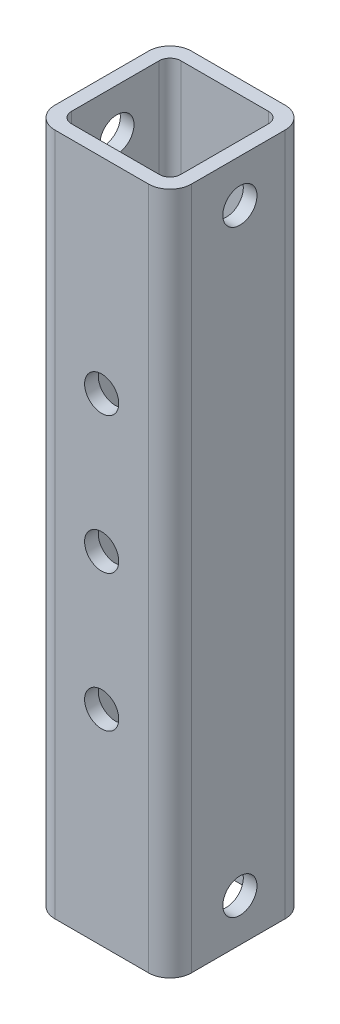
ISO-10303-21;
HEADER;
FILE_DESCRIPTION(('STEP AP214'),'2;1');
FILE_NAME('part.step','',(''),(''),'','','');
FILE_SCHEMA(('AUTOMOTIVE_DESIGN { 1 0 10303 214 1 1 1 1 }'));
ENDSEC;
DATA;
#1=APPLICATION_CONTEXT('core data for automotive mechanical design processes');
#2=APPLICATION_PROTOCOL_DEFINITION('international standard','automotive_design',2000,#1);
#3=PRODUCT_CONTEXT('',#1,'mechanical');
#4=PRODUCT('Part','Part','',(#3));
#5=PRODUCT_RELATED_PRODUCT_CATEGORY('part','',(#4));
#6=PRODUCT_DEFINITION_FORMATION('','',#4);
#7=PRODUCT_DEFINITION_CONTEXT('part definition',#1,'design');
#8=PRODUCT_DEFINITION('design','',#6,#7);
#9=PRODUCT_DEFINITION_SHAPE('','',#8);
#10=(LENGTH_UNIT() NAMED_UNIT(*) SI_UNIT(.MILLI.,.METRE.));
#11=(NAMED_UNIT(*) PLANE_ANGLE_UNIT() SI_UNIT($,.RADIAN.));
#12=(NAMED_UNIT(*) SI_UNIT($,.STERADIAN.) SOLID_ANGLE_UNIT());
#13=UNCERTAINTY_MEASURE_WITH_UNIT(LENGTH_MEASURE(1.E-05),#10,'distance_accuracy_value','');
#14=(GEOMETRIC_REPRESENTATION_CONTEXT(3) GLOBAL_UNCERTAINTY_ASSIGNED_CONTEXT((#13)) GLOBAL_UNIT_ASSIGNED_CONTEXT((#10,
#11,#12)) REPRESENTATION_CONTEXT('',''));
#15=CARTESIAN_POINT('',(0.,0.,0.));
#16=DIRECTION('',(0.,0.,1.));
#17=DIRECTION('',(1.,0.,0.));
#18=AXIS2_PLACEMENT_3D('',#15,#16,#17);
#19=CARTESIAN_POINT('',(4.,127.,-21.4));
#20=DIRECTION('',(0.,-1.,0.));
#21=DIRECTION('',(0.,0.,-1.));
#22=AXIS2_PLACEMENT_3D('',#19,#20,#21);
#23=PLANE('',#22);
#24=CARTESIAN_POINT('',(4.,127.,-21.4));
#25=DIRECTION('',(0.,1.,0.));
#26=DIRECTION('',(0.,0.,-1.));
#27=AXIS2_PLACEMENT_3D('',#24,#25,#26);
#28=CIRCLE('',#27,4.);
#29=CARTESIAN_POINT('',(4.00000000000003,127.,-25.4));
#30=VERTEX_POINT('',#29);
#31=CARTESIAN_POINT('',(0.,127.,-21.4));
#32=VERTEX_POINT('',#31);
#33=EDGE_CURVE('E227',#30,#32,#28,.T.);
#34=ORIENTED_EDGE('',*,*,#33,.T.);
#35=DIRECTION('',(0.,0.,1.));
#36=VECTOR('',#35,1.);
#37=CARTESIAN_POINT('',(0.,127.,-4.00000000000003));
#38=LINE('',#37,#36);
#39=CARTESIAN_POINT('',(0.,127.,-4.00000000000003));
#40=VERTEX_POINT('',#39);
#41=EDGE_CURVE('E230',#32,#40,#38,.T.);
#42=ORIENTED_EDGE('',*,*,#41,.T.);
#43=CARTESIAN_POINT('',(4.,127.,-4.));
#44=DIRECTION('',(0.,1.,0.));
#45=DIRECTION('',(0.,0.,-1.));
#46=AXIS2_PLACEMENT_3D('',#43,#44,#45);
#47=CIRCLE('',#46,4.);
#48=CARTESIAN_POINT('',(4.00000000000003,127.,0.));
#49=VERTEX_POINT('',#48);
#50=EDGE_CURVE('E233',#40,#49,#47,.T.);
#51=ORIENTED_EDGE('',*,*,#50,.T.);
#52=DIRECTION('',(1.,0.,0.));
#53=VECTOR('',#52,1.);
#54=CARTESIAN_POINT('',(4.00000000000003,127.,0.));
#55=LINE('',#54,#53);
#56=CARTESIAN_POINT('',(21.4,127.,0.));
#57=VERTEX_POINT('',#56);
#58=EDGE_CURVE('E235',#49,#57,#55,.T.);
#59=ORIENTED_EDGE('',*,*,#58,.T.);
#60=CARTESIAN_POINT('',(21.4,127.,-4.));
#61=DIRECTION('',(0.,1.,0.));
#62=DIRECTION('',(0.,0.,1.));
#63=AXIS2_PLACEMENT_3D('',#60,#61,#62);
#64=CIRCLE('',#63,4.);
#65=CARTESIAN_POINT('',(25.4,127.,-4.00000000000003));
#66=VERTEX_POINT('',#65);
#67=EDGE_CURVE('E237',#57,#66,#64,.T.);
#68=ORIENTED_EDGE('',*,*,#67,.T.);
#69=DIRECTION('',(0.,0.,-1.));
#70=VECTOR('',#69,1.);
#71=CARTESIAN_POINT('',(25.4,127.,-4.00000000000003));
#72=LINE('',#71,#70);
#73=CARTESIAN_POINT('',(25.4,127.,-21.4));
#74=VERTEX_POINT('',#73);
#75=EDGE_CURVE('E239',#66,#74,#72,.T.);
#76=ORIENTED_EDGE('',*,*,#75,.T.);
#77=CARTESIAN_POINT('',(21.4,127.,-21.4));
#78=DIRECTION('',(0.,1.,0.));
#79=DIRECTION('',(0.,0.,-1.));
#80=AXIS2_PLACEMENT_3D('',#77,#78,#79);
#81=CIRCLE('',#80,4.);
#82=CARTESIAN_POINT('',(21.4,127.,-25.4));
#83=VERTEX_POINT('',#82);
#84=EDGE_CURVE('E241',#74,#83,#81,.T.);
#85=ORIENTED_EDGE('',*,*,#84,.T.);
#86=DIRECTION('',(-1.,0.,0.));
#87=VECTOR('',#86,1.);
#88=CARTESIAN_POINT('',(4.00000000000003,127.,-25.4));
#89=LINE('',#88,#87);
#90=EDGE_CURVE('E243',#83,#30,#89,.T.);
#91=ORIENTED_EDGE('',*,*,#90,.T.);
#92=EDGE_LOOP('',(#34,#42,#51,#59,#68,#76,#85,#91));
#93=FACE_BOUND('',#92,.T.);
#94=CARTESIAN_POINT('',(4.54,127.,-20.86));
#95=DIRECTION('',(0.,1.,0.));
#96=DIRECTION('',(0.,0.,-1.));
#97=AXIS2_PLACEMENT_3D('',#94,#95,#96);
#98=CIRCLE('',#97,2.);
#99=CARTESIAN_POINT('',(4.54000000000002,127.,-22.86));
#100=VERTEX_POINT('',#99);
#101=CARTESIAN_POINT('',(2.54,127.,-20.86));
#102=VERTEX_POINT('',#101);
#103=EDGE_CURVE('E160',#100,#102,#98,.T.);
#104=ORIENTED_EDGE('',*,*,#103,.F.);
#105=DIRECTION('',(-1.,0.,0.));
#106=VECTOR('',#105,1.);
#107=CARTESIAN_POINT('',(20.86,127.,-22.86));
#108=LINE('',#107,#106);
#109=CARTESIAN_POINT('',(20.86,127.,-22.86));
#110=VERTEX_POINT('',#109);
#111=EDGE_CURVE('E194',#110,#100,#108,.T.);
#112=ORIENTED_EDGE('',*,*,#111,.F.);
#113=CARTESIAN_POINT('',(20.86,127.,-20.86));
#114=DIRECTION('',(0.,1.,0.));
#115=DIRECTION('',(0.,0.,1.));
#116=AXIS2_PLACEMENT_3D('',#113,#114,#115);
#117=CIRCLE('',#116,2.);
#118=CARTESIAN_POINT('',(22.86,127.,-20.86));
#119=VERTEX_POINT('',#118);
#120=EDGE_CURVE('E192',#119,#110,#117,.T.);
#121=ORIENTED_EDGE('',*,*,#120,.F.);
#122=DIRECTION('',(0.,0.,-1.));
#123=VECTOR('',#122,1.);
#124=CARTESIAN_POINT('',(22.86,127.,-4.54000000000001));
#125=LINE('',#124,#123);
#126=CARTESIAN_POINT('',(22.86,127.,-4.54000000000001));
#127=VERTEX_POINT('',#126);
#128=EDGE_CURVE('E190',#127,#119,#125,.T.);
#129=ORIENTED_EDGE('',*,*,#128,.F.);
#130=CARTESIAN_POINT('',(20.86,127.,-4.54));
#131=DIRECTION('',(0.,1.,0.));
#132=DIRECTION('',(0.,0.,-1.));
#133=AXIS2_PLACEMENT_3D('',#130,#131,#132);
#134=CIRCLE('',#133,2.);
#135=CARTESIAN_POINT('',(20.86,127.,-2.54));
#136=VERTEX_POINT('',#135);
#137=EDGE_CURVE('E188',#136,#127,#134,.T.);
#138=ORIENTED_EDGE('',*,*,#137,.F.);
#139=DIRECTION('',(1.,0.,0.));
#140=VECTOR('',#139,1.);
#141=CARTESIAN_POINT('',(20.86,127.,-2.54));
#142=LINE('',#141,#140);
#143=CARTESIAN_POINT('',(4.54000000000002,127.,-2.54));
#144=VERTEX_POINT('',#143);
#145=EDGE_CURVE('E183',#144,#136,#142,.T.);
#146=ORIENTED_EDGE('',*,*,#145,.F.);
#147=CARTESIAN_POINT('',(4.54,127.,-4.54));
#148=DIRECTION('',(0.,1.,0.));
#149=DIRECTION('',(0.,0.,-1.));
#150=AXIS2_PLACEMENT_3D('',#147,#148,#149);
#151=CIRCLE('',#150,2.);
#152=CARTESIAN_POINT('',(2.54,127.,-4.54000000000001));
#153=VERTEX_POINT('',#152);
#154=EDGE_CURVE('E181',#153,#144,#151,.T.);
#155=ORIENTED_EDGE('',*,*,#154,.F.);
#156=DIRECTION('',(0.,0.,1.));
#157=VECTOR('',#156,1.);
#158=CARTESIAN_POINT('',(2.54,127.,-4.54000000000001));
#159=LINE('',#158,#157);
#160=EDGE_CURVE('E168',#102,#153,#159,.T.);
#161=ORIENTED_EDGE('',*,*,#160,.F.);
#162=EDGE_LOOP('',(#104,#112,#121,#129,#138,#146,#155,#161));
#163=FACE_BOUND('',#162,.T.);
#164=ADVANCED_FACE('F45',(#93,#163),#23,.F.);
#165=CARTESIAN_POINT('',(4.,0.,-21.4));
#166=DIRECTION('',(0.,-1.,0.));
#167=DIRECTION('',(0.,0.,-1.));
#168=AXIS2_PLACEMENT_3D('',#165,#166,#167);
#169=PLANE('',#168);
#170=CARTESIAN_POINT('',(4.,0.,-21.4));
#171=DIRECTION('',(0.,1.,0.));
#172=DIRECTION('',(0.,0.,-1.));
#173=AXIS2_PLACEMENT_3D('',#170,#171,#172);
#174=CIRCLE('',#173,4.);
#175=CARTESIAN_POINT('',(4.00000000000003,0.,-25.4));
#176=VERTEX_POINT('',#175);
#177=CARTESIAN_POINT('',(0.,0.,-21.4));
#178=VERTEX_POINT('',#177);
#179=EDGE_CURVE('E176',#176,#178,#174,.T.);
#180=ORIENTED_EDGE('',*,*,#179,.F.);
#181=DIRECTION('',(-1.,0.,0.));
#182=VECTOR('',#181,1.);
#183=CARTESIAN_POINT('',(4.00000000000003,0.,-25.4));
#184=LINE('',#183,#182);
#185=CARTESIAN_POINT('',(21.4,0.,-25.4));
#186=VERTEX_POINT('',#185);
#187=EDGE_CURVE('E231',#186,#176,#184,.T.);
#188=ORIENTED_EDGE('',*,*,#187,.F.);
#189=CARTESIAN_POINT('',(21.4,0.,-21.4));
#190=DIRECTION('',(0.,1.,0.));
#191=DIRECTION('',(0.,0.,-1.));
#192=AXIS2_PLACEMENT_3D('',#189,#190,#191);
#193=CIRCLE('',#192,4.);
#194=CARTESIAN_POINT('',(25.4,0.,-21.4));
#195=VERTEX_POINT('',#194);
#196=EDGE_CURVE('E258',#195,#186,#193,.T.);
#197=ORIENTED_EDGE('',*,*,#196,.F.);
#198=DIRECTION('',(0.,0.,-1.));
#199=VECTOR('',#198,1.);
#200=CARTESIAN_POINT('',(25.4,0.,-4.00000000000003));
#201=LINE('',#200,#199);
#202=CARTESIAN_POINT('',(25.4,0.,-4.00000000000003));
#203=VERTEX_POINT('',#202);
#204=EDGE_CURVE('E256',#203,#195,#201,.T.);
#205=ORIENTED_EDGE('',*,*,#204,.F.);
#206=CARTESIAN_POINT('',(21.4,0.,-4.));
#207=DIRECTION('',(0.,1.,0.));
#208=DIRECTION('',(0.,0.,1.));
#209=AXIS2_PLACEMENT_3D('',#206,#207,#208);
#210=CIRCLE('',#209,4.);
#211=CARTESIAN_POINT('',(21.4,0.,0.));
#212=VERTEX_POINT('',#211);
#213=EDGE_CURVE('E254',#212,#203,#210,.T.);
#214=ORIENTED_EDGE('',*,*,#213,.F.);
#215=DIRECTION('',(1.,0.,0.));
#216=VECTOR('',#215,1.);
#217=CARTESIAN_POINT('',(4.00000000000003,0.,0.));
#218=LINE('',#217,#216);
#219=CARTESIAN_POINT('',(4.00000000000003,0.,0.));
#220=VERTEX_POINT('',#219);
#221=EDGE_CURVE('E252',#220,#212,#218,.T.);
#222=ORIENTED_EDGE('',*,*,#221,.F.);
#223=CARTESIAN_POINT('',(4.,0.,-4.));
#224=DIRECTION('',(0.,1.,0.));
#225=DIRECTION('',(0.,0.,-1.));
#226=AXIS2_PLACEMENT_3D('',#223,#224,#225);
#227=CIRCLE('',#226,4.);
#228=CARTESIAN_POINT('',(0.,0.,-4.00000000000003));
#229=VERTEX_POINT('',#228);
#230=EDGE_CURVE('E250',#229,#220,#227,.T.);
#231=ORIENTED_EDGE('',*,*,#230,.F.);
#232=DIRECTION('',(0.,0.,1.));
#233=VECTOR('',#232,1.);
#234=CARTESIAN_POINT('',(0.,0.,-4.00000000000003));
#235=LINE('',#234,#233);
#236=EDGE_CURVE('E248',#178,#229,#235,.T.);
#237=ORIENTED_EDGE('',*,*,#236,.F.);
#238=EDGE_LOOP('',(#180,#188,#197,#205,#214,#222,#231,#237));
#239=FACE_BOUND('',#238,.T.);
#240=DIRECTION('',(-1.,0.,0.));
#241=VECTOR('',#240,1.);
#242=CARTESIAN_POINT('',(20.86,0.,-22.86));
#243=LINE('',#242,#241);
#244=CARTESIAN_POINT('',(20.86,0.,-22.86));
#245=VERTEX_POINT('',#244);
#246=CARTESIAN_POINT('',(4.54000000000002,0.,-22.86));
#247=VERTEX_POINT('',#246);
#248=EDGE_CURVE('E169',#245,#247,#243,.T.);
#249=ORIENTED_EDGE('',*,*,#248,.T.);
#250=CARTESIAN_POINT('',(4.54,0.,-20.86));
#251=DIRECTION('',(0.,1.,0.));
#252=DIRECTION('',(0.,0.,-1.));
#253=AXIS2_PLACEMENT_3D('',#250,#251,#252);
#254=CIRCLE('',#253,2.);
#255=CARTESIAN_POINT('',(2.54,0.,-20.86));
#256=VERTEX_POINT('',#255);
#257=EDGE_CURVE('E70',#247,#256,#254,.T.);
#258=ORIENTED_EDGE('',*,*,#257,.T.);
#259=DIRECTION('',(0.,0.,1.));
#260=VECTOR('',#259,1.);
#261=CARTESIAN_POINT('',(2.54,0.,-4.54000000000001));
#262=LINE('',#261,#260);
#263=CARTESIAN_POINT('',(2.54,0.,-4.54000000000001));
#264=VERTEX_POINT('',#263);
#265=EDGE_CURVE('E175',#256,#264,#262,.T.);
#266=ORIENTED_EDGE('',*,*,#265,.T.);
#267=CARTESIAN_POINT('',(4.54,0.,-4.54));
#268=DIRECTION('',(0.,1.,0.));
#269=DIRECTION('',(0.,0.,-1.));
#270=AXIS2_PLACEMENT_3D('',#267,#268,#269);
#271=CIRCLE('',#270,2.);
#272=CARTESIAN_POINT('',(4.54000000000002,0.,-2.54));
#273=VERTEX_POINT('',#272);
#274=EDGE_CURVE('E199',#264,#273,#271,.T.);
#275=ORIENTED_EDGE('',*,*,#274,.T.);
#276=DIRECTION('',(1.,0.,0.));
#277=VECTOR('',#276,1.);
#278=CARTESIAN_POINT('',(20.86,0.,-2.54));
#279=LINE('',#278,#277);
#280=CARTESIAN_POINT('',(20.86,0.,-2.54));
#281=VERTEX_POINT('',#280);
#282=EDGE_CURVE('E202',#273,#281,#279,.T.);
#283=ORIENTED_EDGE('',*,*,#282,.T.);
#284=CARTESIAN_POINT('',(20.86,0.,-4.54));
#285=DIRECTION('',(0.,1.,0.));
#286=DIRECTION('',(0.,0.,-1.));
#287=AXIS2_PLACEMENT_3D('',#284,#285,#286);
#288=CIRCLE('',#287,2.);
#289=CARTESIAN_POINT('',(22.86,0.,-4.54000000000001));
#290=VERTEX_POINT('',#289);
#291=EDGE_CURVE('E205',#281,#290,#288,.T.);
#292=ORIENTED_EDGE('',*,*,#291,.T.);
#293=DIRECTION('',(0.,0.,-1.));
#294=VECTOR('',#293,1.);
#295=CARTESIAN_POINT('',(22.86,0.,-4.54000000000001));
#296=LINE('',#295,#294);
#297=CARTESIAN_POINT('',(22.86,0.,-20.86));
#298=VERTEX_POINT('',#297);
#299=EDGE_CURVE('E208',#290,#298,#296,.T.);
#300=ORIENTED_EDGE('',*,*,#299,.T.);
#301=CARTESIAN_POINT('',(20.86,0.,-20.86));
#302=DIRECTION('',(0.,1.,0.));
#303=DIRECTION('',(0.,0.,1.));
#304=AXIS2_PLACEMENT_3D('',#301,#302,#303);
#305=CIRCLE('',#304,2.);
#306=EDGE_CURVE('E211',#298,#245,#305,.T.);
#307=ORIENTED_EDGE('',*,*,#306,.T.);
#308=EDGE_LOOP('',(#249,#258,#266,#275,#283,#292,#300,#307));
#309=FACE_BOUND('',#308,.T.);
#310=ADVANCED_FACE('F362',(#239,#309),#169,.T.);
#311=CARTESIAN_POINT('',(4.,127.,-21.4));
#312=DIRECTION('',(0.,-1.,0.));
#313=DIRECTION('',(0.,0.,-1.));
#314=AXIS2_PLACEMENT_3D('',#311,#312,#313);
#315=CYLINDRICAL_SURFACE('',#314,4.);
#316=ORIENTED_EDGE('',*,*,#179,.T.);
#317=DIRECTION('',(0.,-1.,0.));
#318=VECTOR('',#317,1.);
#319=CARTESIAN_POINT('',(0.,127.,-21.4));
#320=LINE('',#319,#318);
#321=EDGE_CURVE('E13',#32,#178,#320,.T.);
#322=ORIENTED_EDGE('',*,*,#321,.F.);
#323=ORIENTED_EDGE('',*,*,#33,.F.);
#324=DIRECTION('',(0.,-1.,0.));
#325=VECTOR('',#324,1.);
#326=CARTESIAN_POINT('',(4.00000000000003,127.,-25.4));
#327=LINE('',#326,#325);
#328=EDGE_CURVE('E245',#30,#176,#327,.T.);
#329=ORIENTED_EDGE('',*,*,#328,.T.);
#330=EDGE_LOOP('',(#316,#322,#323,#329));
#331=FACE_BOUND('',#330,.T.);
#332=ADVANCED_FACE('F47',(#331),#315,.T.);
#333=CARTESIAN_POINT('',(0.,127.,-4.00000000000003));
#334=DIRECTION('',(1.,0.,0.));
#335=DIRECTION('',(0.,0.,-1.));
#336=AXIS2_PLACEMENT_3D('',#333,#334,#335);
#337=PLANE('',#336);
#338=CARTESIAN_POINT('',(0.,119.0625,-12.9920999999989));
#339=DIRECTION('',(1.,0.,0.));
#340=DIRECTION('',(0.,0.,-1.));
#341=AXIS2_PLACEMENT_3D('',#338,#339,#340);
#342=CIRCLE('',#341,3.175);
#343=CARTESIAN_POINT('',(0.,119.0625,-16.1670999999989));
#344=VERTEX_POINT('',#343);
#345=EDGE_CURVE('E325',#344,#344,#342,.T.);
#346=ORIENTED_EDGE('',*,*,#345,.T.);
#347=EDGE_LOOP('',(#346));
#348=FACE_BOUND('',#347,.T.);
#349=CARTESIAN_POINT('',(0.,7.93749999999997,-12.9920999999988));
#350=DIRECTION('',(1.,0.,0.));
#351=DIRECTION('',(0.,0.,-1.));
#352=AXIS2_PLACEMENT_3D('',#349,#350,#351);
#353=CIRCLE('',#352,3.175);
#354=CARTESIAN_POINT('',(0.,7.93749999999997,-16.1670999999988));
#355=VERTEX_POINT('',#354);
#356=EDGE_CURVE('E332',#355,#355,#353,.T.);
#357=ORIENTED_EDGE('',*,*,#356,.T.);
#358=EDGE_LOOP('',(#357));
#359=FACE_BOUND('',#358,.T.);
#360=ORIENTED_EDGE('',*,*,#236,.T.);
#361=DIRECTION('',(0.,-1.,0.));
#362=VECTOR('',#361,1.);
#363=CARTESIAN_POINT('',(0.,127.,-4.00000000000003));
#364=LINE('',#363,#362);
#365=EDGE_CURVE('E54',#40,#229,#364,.T.);
#366=ORIENTED_EDGE('',*,*,#365,.F.);
#367=ORIENTED_EDGE('',*,*,#41,.F.);
#368=ORIENTED_EDGE('',*,*,#321,.T.);
#369=EDGE_LOOP('',(#360,#366,#367,#368));
#370=FACE_BOUND('',#369,.T.);
#371=ADVANCED_FACE('F348',(#348,#359,#370),#337,.F.);
#372=CARTESIAN_POINT('',(4.,127.,-4.));
#373=DIRECTION('',(0.,-1.,0.));
#374=DIRECTION('',(0.,0.,-1.));
#375=AXIS2_PLACEMENT_3D('',#372,#373,#374);
#376=CYLINDRICAL_SURFACE('',#375,4.);
#377=ORIENTED_EDGE('',*,*,#230,.T.);
#378=DIRECTION('',(0.,-1.,0.));
#379=VECTOR('',#378,1.);
#380=CARTESIAN_POINT('',(4.00000000000003,127.,0.));
#381=LINE('',#380,#379);
#382=EDGE_CURVE('E275',#49,#220,#381,.T.);
#383=ORIENTED_EDGE('',*,*,#382,.F.);
#384=ORIENTED_EDGE('',*,*,#50,.F.);
#385=ORIENTED_EDGE('',*,*,#365,.T.);
#386=EDGE_LOOP('',(#377,#383,#384,#385));
#387=FACE_BOUND('',#386,.T.);
#388=ADVANCED_FACE('F351',(#387),#376,.T.);
#389=CARTESIAN_POINT('',(4.00000000000003,127.,0.));
#390=DIRECTION('',(0.,0.,-1.));
#391=DIRECTION('',(-1.,0.,0.));
#392=AXIS2_PLACEMENT_3D('',#389,#390,#391);
#393=PLANE('',#392);
#394=CARTESIAN_POINT('',(12.6995125739966,63.5000000000006,0.));
#395=DIRECTION('',(0.,0.,-1.));
#396=DIRECTION('',(-1.,0.,0.));
#397=AXIS2_PLACEMENT_3D('',#394,#395,#396);
#398=CIRCLE('',#397,3.17500000000001);
#399=CARTESIAN_POINT('',(9.52451257399659,63.5000000000006,0.));
#400=VERTEX_POINT('',#399);
#401=EDGE_CURVE('E296',#400,#400,#398,.T.);
#402=ORIENTED_EDGE('',*,*,#401,.T.);
#403=EDGE_LOOP('',(#402));
#404=FACE_BOUND('',#403,.T.);
#405=CARTESIAN_POINT('',(12.6995125739963,38.1000000000006,0.));
#406=DIRECTION('',(0.,0.,-1.));
#407=DIRECTION('',(-1.,0.,0.));
#408=AXIS2_PLACEMENT_3D('',#405,#406,#407);
#409=CIRCLE('',#408,3.17500000000001);
#410=CARTESIAN_POINT('',(9.52451257399631,38.1000000000006,0.));
#411=VERTEX_POINT('',#410);
#412=EDGE_CURVE('E303',#411,#411,#409,.T.);
#413=ORIENTED_EDGE('',*,*,#412,.T.);
#414=EDGE_LOOP('',(#413));
#415=FACE_BOUND('',#414,.T.);
#416=CARTESIAN_POINT('',(12.6995125739967,88.9000000000006,0.));
#417=DIRECTION('',(0.,0.,-1.));
#418=DIRECTION('',(-1.,0.,0.));
#419=AXIS2_PLACEMENT_3D('',#416,#417,#418);
#420=CIRCLE('',#419,3.17499999999998);
#421=CARTESIAN_POINT('',(9.52451257399667,88.9000000000006,0.));
#422=VERTEX_POINT('',#421);
#423=EDGE_CURVE('E292',#422,#422,#420,.T.);
#424=ORIENTED_EDGE('',*,*,#423,.T.);
#425=EDGE_LOOP('',(#424));
#426=FACE_BOUND('',#425,.T.);
#427=ORIENTED_EDGE('',*,*,#221,.T.);
#428=DIRECTION('',(0.,-1.,0.));
#429=VECTOR('',#428,1.);
#430=CARTESIAN_POINT('',(21.4,127.,0.));
#431=LINE('',#430,#429);
#432=EDGE_CURVE('E272',#57,#212,#431,.T.);
#433=ORIENTED_EDGE('',*,*,#432,.F.);
#434=ORIENTED_EDGE('',*,*,#58,.F.);
#435=ORIENTED_EDGE('',*,*,#382,.T.);
#436=EDGE_LOOP('',(#427,#433,#434,#435));
#437=FACE_BOUND('',#436,.T.);
#438=ADVANCED_FACE('F368',(#404,#415,#426,#437),#393,.F.);
#439=CARTESIAN_POINT('',(21.4,127.,-4.));
#440=DIRECTION('',(0.,-1.,0.));
#441=DIRECTION('',(0.,0.,-1.));
#442=AXIS2_PLACEMENT_3D('',#439,#440,#441);
#443=CYLINDRICAL_SURFACE('',#442,4.);
#444=ORIENTED_EDGE('',*,*,#213,.T.);
#445=DIRECTION('',(0.,-1.,0.));
#446=VECTOR('',#445,1.);
#447=CARTESIAN_POINT('',(25.4,127.,-4.00000000000003));
#448=LINE('',#447,#446);
#449=EDGE_CURVE('E269',#66,#203,#448,.T.);
#450=ORIENTED_EDGE('',*,*,#449,.F.);
#451=ORIENTED_EDGE('',*,*,#67,.F.);
#452=ORIENTED_EDGE('',*,*,#432,.T.);
#453=EDGE_LOOP('',(#444,#450,#451,#452));
#454=FACE_BOUND('',#453,.T.);
#455=ADVANCED_FACE('F372',(#454),#443,.T.);
#456=CARTESIAN_POINT('',(25.4,127.,-4.00000000000003));
#457=DIRECTION('',(-1.,0.,0.));
#458=DIRECTION('',(0.,0.,1.));
#459=AXIS2_PLACEMENT_3D('',#456,#457,#458);
#460=PLANE('',#459);
#461=CARTESIAN_POINT('',(25.4,119.0625,-12.9920999999989));
#462=DIRECTION('',(-1.,0.,0.));
#463=DIRECTION('',(0.,0.,1.));
#464=AXIS2_PLACEMENT_3D('',#461,#462,#463);
#465=CIRCLE('',#464,3.175);
#466=CARTESIAN_POINT('',(25.4,119.0625,-9.81709999999885));
#467=VERTEX_POINT('',#466);
#468=EDGE_CURVE('E288',#467,#467,#465,.T.);
#469=ORIENTED_EDGE('',*,*,#468,.T.);
#470=EDGE_LOOP('',(#469));
#471=FACE_BOUND('',#470,.T.);
#472=CARTESIAN_POINT('',(25.4,7.93749999999997,-12.9920999999988));
#473=DIRECTION('',(-1.,0.,0.));
#474=DIRECTION('',(0.,0.,1.));
#475=AXIS2_PLACEMENT_3D('',#472,#473,#474);
#476=CIRCLE('',#475,3.175);
#477=CARTESIAN_POINT('',(25.4,7.93749999999997,-9.81709999999883));
#478=VERTEX_POINT('',#477);
#479=EDGE_CURVE('E283',#478,#478,#476,.T.);
#480=ORIENTED_EDGE('',*,*,#479,.T.);
#481=EDGE_LOOP('',(#480));
#482=FACE_BOUND('',#481,.T.);
#483=ORIENTED_EDGE('',*,*,#204,.T.);
#484=DIRECTION('',(0.,-1.,0.));
#485=VECTOR('',#484,1.);
#486=CARTESIAN_POINT('',(25.4,127.,-21.4));
#487=LINE('',#486,#485);
#488=EDGE_CURVE('E266',#74,#195,#487,.T.);
#489=ORIENTED_EDGE('',*,*,#488,.F.);
#490=ORIENTED_EDGE('',*,*,#75,.F.);
#491=ORIENTED_EDGE('',*,*,#449,.T.);
#492=EDGE_LOOP('',(#483,#489,#490,#491));
#493=FACE_BOUND('',#492,.T.);
#494=ADVANCED_FACE('F390',(#471,#482,#493),#460,.F.);
#495=CARTESIAN_POINT('',(21.4,127.,-21.4));
#496=DIRECTION('',(0.,-1.,0.));
#497=DIRECTION('',(0.,0.,-1.));
#498=AXIS2_PLACEMENT_3D('',#495,#496,#497);
#499=CYLINDRICAL_SURFACE('',#498,4.);
#500=ORIENTED_EDGE('',*,*,#196,.T.);
#501=DIRECTION('',(0.,-1.,0.));
#502=VECTOR('',#501,1.);
#503=CARTESIAN_POINT('',(21.4,127.,-25.4));
#504=LINE('',#503,#502);
#505=EDGE_CURVE('E263',#83,#186,#504,.T.);
#506=ORIENTED_EDGE('',*,*,#505,.F.);
#507=ORIENTED_EDGE('',*,*,#84,.F.);
#508=ORIENTED_EDGE('',*,*,#488,.T.);
#509=EDGE_LOOP('',(#500,#506,#507,#508));
#510=FACE_BOUND('',#509,.T.);
#511=ADVANCED_FACE('F388',(#510),#499,.T.);
#512=CARTESIAN_POINT('',(4.00000000000003,127.,-25.4));
#513=DIRECTION('',(0.,0.,1.));
#514=DIRECTION('',(1.,0.,0.));
#515=AXIS2_PLACEMENT_3D('',#512,#513,#514);
#516=PLANE('',#515);
#517=CARTESIAN_POINT('',(12.6995125739966,63.5000000000006,-25.4));
#518=DIRECTION('',(0.,0.,1.));
#519=DIRECTION('',(1.,0.,0.));
#520=AXIS2_PLACEMENT_3D('',#517,#518,#519);
#521=CIRCLE('',#520,3.17500000000001);
#522=CARTESIAN_POINT('',(15.8745125739966,63.5000000000006,-25.4));
#523=VERTEX_POINT('',#522);
#524=EDGE_CURVE('E315',#523,#523,#521,.T.);
#525=ORIENTED_EDGE('',*,*,#524,.T.);
#526=EDGE_LOOP('',(#525));
#527=FACE_BOUND('',#526,.T.);
#528=CARTESIAN_POINT('',(12.6995125739963,38.1000000000006,-25.4));
#529=DIRECTION('',(0.,0.,1.));
#530=DIRECTION('',(1.,0.,0.));
#531=AXIS2_PLACEMENT_3D('',#528,#529,#530);
#532=CIRCLE('',#531,3.17500000000001);
#533=CARTESIAN_POINT('',(15.8745125739963,38.1000000000006,-25.4));
#534=VERTEX_POINT('',#533);
#535=EDGE_CURVE('E300',#534,#534,#532,.T.);
#536=ORIENTED_EDGE('',*,*,#535,.T.);
#537=EDGE_LOOP('',(#536));
#538=FACE_BOUND('',#537,.T.);
#539=CARTESIAN_POINT('',(12.6995125739967,88.9000000000006,-25.4));
#540=DIRECTION('',(0.,0.,1.));
#541=DIRECTION('',(1.,0.,0.));
#542=AXIS2_PLACEMENT_3D('',#539,#540,#541);
#543=CIRCLE('',#542,3.17499999999998);
#544=CARTESIAN_POINT('',(15.8745125739966,88.9000000000006,-25.4));
#545=VERTEX_POINT('',#544);
#546=EDGE_CURVE('E322',#545,#545,#543,.T.);
#547=ORIENTED_EDGE('',*,*,#546,.T.);
#548=EDGE_LOOP('',(#547));
#549=FACE_BOUND('',#548,.T.);
#550=ORIENTED_EDGE('',*,*,#187,.T.);
#551=ORIENTED_EDGE('',*,*,#328,.F.);
#552=ORIENTED_EDGE('',*,*,#90,.F.);
#553=ORIENTED_EDGE('',*,*,#505,.T.);
#554=EDGE_LOOP('',(#550,#551,#552,#553));
#555=FACE_BOUND('',#554,.T.);
#556=ADVANCED_FACE('F384',(#527,#538,#549,#555),#516,.F.);
#557=CARTESIAN_POINT('',(4.54,127.,-20.86));
#558=DIRECTION('',(0.,-1.,0.));
#559=DIRECTION('',(0.,0.,-1.));
#560=AXIS2_PLACEMENT_3D('',#557,#558,#559);
#561=CYLINDRICAL_SURFACE('',#560,2.);
#562=ORIENTED_EDGE('',*,*,#257,.F.);
#563=DIRECTION('',(0.,-1.,0.));
#564=VECTOR('',#563,1.);
#565=CARTESIAN_POINT('',(4.54000000000002,127.,-22.86));
#566=LINE('',#565,#564);
#567=EDGE_CURVE('E164',#100,#247,#566,.T.);
#568=ORIENTED_EDGE('',*,*,#567,.F.);
#569=ORIENTED_EDGE('',*,*,#103,.T.);
#570=DIRECTION('',(0.,-1.,0.));
#571=VECTOR('',#570,1.);
#572=CARTESIAN_POINT('',(2.54,127.,-20.86));
#573=LINE('',#572,#571);
#574=EDGE_CURVE('E163',#102,#256,#573,.T.);
#575=ORIENTED_EDGE('',*,*,#574,.T.);
#576=EDGE_LOOP('',(#562,#568,#569,#575));
#577=FACE_BOUND('',#576,.T.);
#578=ADVANCED_FACE('F162',(#577),#561,.F.);
#579=CARTESIAN_POINT('',(2.54,127.,-4.54000000000001));
#580=DIRECTION('',(1.,0.,0.));
#581=DIRECTION('',(0.,0.,-1.));
#582=AXIS2_PLACEMENT_3D('',#579,#580,#581);
#583=PLANE('',#582);
#584=CARTESIAN_POINT('',(2.54,119.0625,-12.9920999999989));
#585=DIRECTION('',(1.,0.,0.));
#586=DIRECTION('',(0.,0.,-1.));
#587=AXIS2_PLACEMENT_3D('',#584,#585,#586);
#588=CIRCLE('',#587,3.175);
#589=CARTESIAN_POINT('',(2.54,119.0625,-16.1670999999989));
#590=VERTEX_POINT('',#589);
#591=EDGE_CURVE('E287',#590,#590,#588,.F.);
#592=ORIENTED_EDGE('',*,*,#591,.T.);
#593=EDGE_LOOP('',(#592));
#594=FACE_BOUND('',#593,.T.);
#595=CARTESIAN_POINT('',(2.54,7.93749999999997,-12.9920999999988));
#596=DIRECTION('',(1.,0.,0.));
#597=DIRECTION('',(0.,0.,-1.));
#598=AXIS2_PLACEMENT_3D('',#595,#596,#597);
#599=CIRCLE('',#598,3.175);
#600=CARTESIAN_POINT('',(2.54,7.93749999999997,-16.1670999999988));
#601=VERTEX_POINT('',#600);
#602=EDGE_CURVE('E197',#601,#601,#599,.F.);
#603=ORIENTED_EDGE('',*,*,#602,.T.);
#604=EDGE_LOOP('',(#603));
#605=FACE_BOUND('',#604,.T.);
#606=ORIENTED_EDGE('',*,*,#265,.F.);
#607=ORIENTED_EDGE('',*,*,#574,.F.);
#608=ORIENTED_EDGE('',*,*,#160,.T.);
#609=DIRECTION('',(0.,-1.,0.));
#610=VECTOR('',#609,1.);
#611=CARTESIAN_POINT('',(2.54,127.,-4.54000000000001));
#612=LINE('',#611,#610);
#613=EDGE_CURVE('E177',#153,#264,#612,.T.);
#614=ORIENTED_EDGE('',*,*,#613,.T.);
#615=EDGE_LOOP('',(#606,#607,#608,#614));
#616=FACE_BOUND('',#615,.T.);
#617=ADVANCED_FACE('F172',(#594,#605,#616),#583,.T.);
#618=CARTESIAN_POINT('',(4.54,127.,-4.54));
#619=DIRECTION('',(0.,-1.,0.));
#620=DIRECTION('',(0.,0.,-1.));
#621=AXIS2_PLACEMENT_3D('',#618,#619,#620);
#622=CYLINDRICAL_SURFACE('',#621,2.);
#623=ORIENTED_EDGE('',*,*,#274,.F.);
#624=ORIENTED_EDGE('',*,*,#613,.F.);
#625=ORIENTED_EDGE('',*,*,#154,.T.);
#626=DIRECTION('',(0.,-1.,0.));
#627=VECTOR('',#626,1.);
#628=CARTESIAN_POINT('',(4.54000000000002,127.,-2.54));
#629=LINE('',#628,#627);
#630=EDGE_CURVE('E224',#144,#273,#629,.T.);
#631=ORIENTED_EDGE('',*,*,#630,.T.);
#632=EDGE_LOOP('',(#623,#624,#625,#631));
#633=FACE_BOUND('',#632,.T.);
#634=ADVANCED_FACE('F463',(#633),#622,.F.);
#635=CARTESIAN_POINT('',(20.86,127.,-2.54));
#636=DIRECTION('',(0.,0.,-1.));
#637=DIRECTION('',(-1.,0.,0.));
#638=AXIS2_PLACEMENT_3D('',#635,#636,#637);
#639=PLANE('',#638);
#640=CARTESIAN_POINT('',(12.6995125739966,63.5000000000006,-2.54));
#641=DIRECTION('',(0.,0.,-1.));
#642=DIRECTION('',(-1.,0.,0.));
#643=AXIS2_PLACEMENT_3D('',#640,#641,#642);
#644=CIRCLE('',#643,3.17500000000001);
#645=CARTESIAN_POINT('',(9.52451257399659,63.5000000000006,-2.54));
#646=VERTEX_POINT('',#645);
#647=EDGE_CURVE('E312',#646,#646,#644,.T.);
#648=ORIENTED_EDGE('',*,*,#647,.F.);
#649=EDGE_LOOP('',(#648));
#650=FACE_BOUND('',#649,.T.);
#651=CARTESIAN_POINT('',(12.6995125739963,38.1000000000006,-2.54));
#652=DIRECTION('',(0.,0.,-1.));
#653=DIRECTION('',(-1.,0.,0.));
#654=AXIS2_PLACEMENT_3D('',#651,#652,#653);
#655=CIRCLE('',#654,3.17500000000001);
#656=CARTESIAN_POINT('',(9.52451257399631,38.1000000000006,-2.54));
#657=VERTEX_POINT('',#656);
#658=EDGE_CURVE('E295',#657,#657,#655,.T.);
#659=ORIENTED_EDGE('',*,*,#658,.F.);
#660=EDGE_LOOP('',(#659));
#661=FACE_BOUND('',#660,.T.);
#662=CARTESIAN_POINT('',(12.6995125739967,88.9000000000006,-2.54));
#663=DIRECTION('',(0.,0.,-1.));
#664=DIRECTION('',(-1.,0.,0.));
#665=AXIS2_PLACEMENT_3D('',#662,#663,#664);
#666=CIRCLE('',#665,3.17499999999998);
#667=CARTESIAN_POINT('',(9.52451257399667,88.9000000000006,-2.54));
#668=VERTEX_POINT('',#667);
#669=EDGE_CURVE('E291',#668,#668,#666,.T.);
#670=ORIENTED_EDGE('',*,*,#669,.F.);
#671=EDGE_LOOP('',(#670));
#672=FACE_BOUND('',#671,.T.);
#673=ORIENTED_EDGE('',*,*,#282,.F.);
#674=ORIENTED_EDGE('',*,*,#630,.F.);
#675=ORIENTED_EDGE('',*,*,#145,.T.);
#676=DIRECTION('',(0.,-1.,0.));
#677=VECTOR('',#676,1.);
#678=CARTESIAN_POINT('',(20.86,127.,-2.54));
#679=LINE('',#678,#677);
#680=EDGE_CURVE('E222',#136,#281,#679,.T.);
#681=ORIENTED_EDGE('',*,*,#680,.T.);
#682=EDGE_LOOP('',(#673,#674,#675,#681));
#683=FACE_BOUND('',#682,.T.);
#684=ADVANCED_FACE('F460',(#650,#661,#672,#683),#639,.T.);
#685=CARTESIAN_POINT('',(20.86,127.,-4.54));
#686=DIRECTION('',(0.,-1.,0.));
#687=DIRECTION('',(0.,0.,-1.));
#688=AXIS2_PLACEMENT_3D('',#685,#686,#687);
#689=CYLINDRICAL_SURFACE('',#688,2.);
#690=ORIENTED_EDGE('',*,*,#291,.F.);
#691=ORIENTED_EDGE('',*,*,#680,.F.);
#692=ORIENTED_EDGE('',*,*,#137,.T.);
#693=DIRECTION('',(0.,-1.,0.));
#694=VECTOR('',#693,1.);
#695=CARTESIAN_POINT('',(22.86,127.,-4.54000000000001));
#696=LINE('',#695,#694);
#697=EDGE_CURVE('E220',#127,#290,#696,.T.);
#698=ORIENTED_EDGE('',*,*,#697,.T.);
#699=EDGE_LOOP('',(#690,#691,#692,#698));
#700=FACE_BOUND('',#699,.T.);
#701=ADVANCED_FACE('F456',(#700),#689,.F.);
#702=CARTESIAN_POINT('',(22.86,127.,-4.54000000000001));
#703=DIRECTION('',(-1.,0.,0.));
#704=DIRECTION('',(0.,0.,1.));
#705=AXIS2_PLACEMENT_3D('',#702,#703,#704);
#706=PLANE('',#705);
#707=CARTESIAN_POINT('',(22.86,119.0625,-12.9920999999989));
#708=DIRECTION('',(-1.,0.,0.));
#709=DIRECTION('',(0.,0.,1.));
#710=AXIS2_PLACEMENT_3D('',#707,#708,#709);
#711=CIRCLE('',#710,3.175);
#712=CARTESIAN_POINT('',(22.86,119.0625,-9.81709999999885));
#713=VERTEX_POINT('',#712);
#714=EDGE_CURVE('E284',#713,#713,#711,.F.);
#715=ORIENTED_EDGE('',*,*,#714,.T.);
#716=EDGE_LOOP('',(#715));
#717=FACE_BOUND('',#716,.T.);
#718=CARTESIAN_POINT('',(22.86,7.93749999999997,-12.9920999999988));
#719=DIRECTION('',(-1.,0.,0.));
#720=DIRECTION('',(0.,0.,1.));
#721=AXIS2_PLACEMENT_3D('',#718,#719,#720);
#722=CIRCLE('',#721,3.175);
#723=CARTESIAN_POINT('',(22.86,7.93749999999997,-9.81709999999883));
#724=VERTEX_POINT('',#723);
#725=EDGE_CURVE('E280',#724,#724,#722,.F.);
#726=ORIENTED_EDGE('',*,*,#725,.T.);
#727=EDGE_LOOP('',(#726));
#728=FACE_BOUND('',#727,.T.);
#729=ORIENTED_EDGE('',*,*,#299,.F.);
#730=ORIENTED_EDGE('',*,*,#697,.F.);
#731=ORIENTED_EDGE('',*,*,#128,.T.);
#732=DIRECTION('',(0.,-1.,0.));
#733=VECTOR('',#732,1.);
#734=CARTESIAN_POINT('',(22.86,127.,-20.86));
#735=LINE('',#734,#733);
#736=EDGE_CURVE('E218',#119,#298,#735,.T.);
#737=ORIENTED_EDGE('',*,*,#736,.T.);
#738=EDGE_LOOP('',(#729,#730,#731,#737));
#739=FACE_BOUND('',#738,.T.);
#740=ADVANCED_FACE('F452',(#717,#728,#739),#706,.T.);
#741=CARTESIAN_POINT('',(20.86,127.,-20.86));
#742=DIRECTION('',(0.,-1.,0.));
#743=DIRECTION('',(0.,0.,-1.));
#744=AXIS2_PLACEMENT_3D('',#741,#742,#743);
#745=CYLINDRICAL_SURFACE('',#744,2.);
#746=ORIENTED_EDGE('',*,*,#306,.F.);
#747=ORIENTED_EDGE('',*,*,#736,.F.);
#748=ORIENTED_EDGE('',*,*,#120,.T.);
#749=DIRECTION('',(0.,-1.,0.));
#750=VECTOR('',#749,1.);
#751=CARTESIAN_POINT('',(20.86,127.,-22.86));
#752=LINE('',#751,#750);
#753=EDGE_CURVE('E62',#110,#245,#752,.T.);
#754=ORIENTED_EDGE('',*,*,#753,.T.);
#755=EDGE_LOOP('',(#746,#747,#748,#754));
#756=FACE_BOUND('',#755,.T.);
#757=ADVANCED_FACE('F448',(#756),#745,.F.);
#758=CARTESIAN_POINT('',(20.86,127.,-22.86));
#759=DIRECTION('',(0.,0.,1.));
#760=DIRECTION('',(1.,0.,0.));
#761=AXIS2_PLACEMENT_3D('',#758,#759,#760);
#762=PLANE('',#761);
#763=CARTESIAN_POINT('',(12.6995125739966,63.5000000000006,-22.86));
#764=DIRECTION('',(0.,0.,1.));
#765=DIRECTION('',(1.,0.,0.));
#766=AXIS2_PLACEMENT_3D('',#763,#764,#765);
#767=CIRCLE('',#766,3.17500000000001);
#768=CARTESIAN_POINT('',(15.8745125739966,63.5000000000006,-22.86));
#769=VERTEX_POINT('',#768);
#770=EDGE_CURVE('E49',#769,#769,#767,.T.);
#771=ORIENTED_EDGE('',*,*,#770,.F.);
#772=EDGE_LOOP('',(#771));
#773=FACE_BOUND('',#772,.T.);
#774=CARTESIAN_POINT('',(12.6995125739963,38.1000000000006,-22.86));
#775=DIRECTION('',(0.,0.,1.));
#776=DIRECTION('',(1.,0.,0.));
#777=AXIS2_PLACEMENT_3D('',#774,#775,#776);
#778=CIRCLE('',#777,3.17500000000001);
#779=CARTESIAN_POINT('',(15.8745125739963,38.1000000000006,-22.86));
#780=VERTEX_POINT('',#779);
#781=EDGE_CURVE('E293',#780,#780,#778,.T.);
#782=ORIENTED_EDGE('',*,*,#781,.F.);
#783=EDGE_LOOP('',(#782));
#784=FACE_BOUND('',#783,.T.);
#785=CARTESIAN_POINT('',(12.6995125739967,88.9000000000006,-22.86));
#786=DIRECTION('',(0.,0.,1.));
#787=DIRECTION('',(1.,0.,0.));
#788=AXIS2_PLACEMENT_3D('',#785,#786,#787);
#789=CIRCLE('',#788,3.17499999999998);
#790=CARTESIAN_POINT('',(15.8745125739966,88.9000000000006,-22.86));
#791=VERTEX_POINT('',#790);
#792=EDGE_CURVE('E289',#791,#791,#789,.T.);
#793=ORIENTED_EDGE('',*,*,#792,.F.);
#794=EDGE_LOOP('',(#793));
#795=FACE_BOUND('',#794,.T.);
#796=ORIENTED_EDGE('',*,*,#248,.F.);
#797=ORIENTED_EDGE('',*,*,#753,.F.);
#798=ORIENTED_EDGE('',*,*,#111,.T.);
#799=ORIENTED_EDGE('',*,*,#567,.T.);
#800=EDGE_LOOP('',(#796,#797,#798,#799));
#801=FACE_BOUND('',#800,.T.);
#802=ADVANCED_FACE('F444',(#773,#784,#795,#801),#762,.T.);
#803=CARTESIAN_POINT('',(34.3802561210692,7.93749999999997,-12.9920999999988));
#804=DIRECTION('',(-1.,0.,0.));
#805=DIRECTION('',(0.,0.,1.));
#806=AXIS2_PLACEMENT_3D('',#803,#804,#805);
#807=CYLINDRICAL_SURFACE('',#806,3.175);
#808=ORIENTED_EDGE('',*,*,#725,.F.);
#809=EDGE_LOOP('',(#808));
#810=FACE_BOUND('',#809,.T.);
#811=ORIENTED_EDGE('',*,*,#479,.F.);
#812=EDGE_LOOP('',(#811));
#813=FACE_BOUND('',#812,.T.);
#814=ADVANCED_FACE('F344',(#810,#813),#807,.F.);
#815=ORIENTED_EDGE('',*,*,#602,.F.);
#816=EDGE_LOOP('',(#815));
#817=FACE_BOUND('',#816,.T.);
#818=ORIENTED_EDGE('',*,*,#356,.F.);
#819=EDGE_LOOP('',(#818));
#820=FACE_BOUND('',#819,.T.);
#821=ADVANCED_FACE('F340',(#817,#820),#807,.F.);
#822=CARTESIAN_POINT('',(34.3802561210692,119.0625,-12.9920999999989));
#823=DIRECTION('',(-1.,0.,0.));
#824=DIRECTION('',(0.,0.,1.));
#825=AXIS2_PLACEMENT_3D('',#822,#823,#824);
#826=CYLINDRICAL_SURFACE('',#825,3.175);
#827=ORIENTED_EDGE('',*,*,#714,.F.);
#828=EDGE_LOOP('',(#827));
#829=FACE_BOUND('',#828,.T.);
#830=ORIENTED_EDGE('',*,*,#468,.F.);
#831=EDGE_LOOP('',(#830));
#832=FACE_BOUND('',#831,.T.);
#833=ADVANCED_FACE('F343',(#829,#832),#826,.F.);
#834=ORIENTED_EDGE('',*,*,#591,.F.);
#835=EDGE_LOOP('',(#834));
#836=FACE_BOUND('',#835,.T.);
#837=ORIENTED_EDGE('',*,*,#345,.F.);
#838=EDGE_LOOP('',(#837));
#839=FACE_BOUND('',#838,.T.);
#840=ADVANCED_FACE('F427',(#836,#839),#826,.F.);
#841=CARTESIAN_POINT('',(12.6995125739967,88.9000000000006,0.));
#842=DIRECTION('',(0.,0.,-1.));
#843=DIRECTION('',(-1.,0.,0.));
#844=AXIS2_PLACEMENT_3D('',#841,#842,#843);
#845=CYLINDRICAL_SURFACE('',#844,3.17499999999998);
#846=ORIENTED_EDGE('',*,*,#792,.T.);
#847=EDGE_LOOP('',(#846));
#848=FACE_BOUND('',#847,.T.);
#849=ORIENTED_EDGE('',*,*,#546,.F.);
#850=EDGE_LOOP('',(#849));
#851=FACE_BOUND('',#850,.T.);
#852=ADVANCED_FACE('F424',(#848,#851),#845,.F.);
#853=ORIENTED_EDGE('',*,*,#669,.T.);
#854=EDGE_LOOP('',(#853));
#855=FACE_BOUND('',#854,.T.);
#856=ORIENTED_EDGE('',*,*,#423,.F.);
#857=EDGE_LOOP('',(#856));
#858=FACE_BOUND('',#857,.T.);
#859=ADVANCED_FACE('F426',(#855,#858),#845,.F.);
#860=CARTESIAN_POINT('',(12.6995125739963,38.1000000000006,0.));
#861=DIRECTION('',(0.,0.,-1.));
#862=DIRECTION('',(-1.,0.,0.));
#863=AXIS2_PLACEMENT_3D('',#860,#861,#862);
#864=CYLINDRICAL_SURFACE('',#863,3.17500000000001);
#865=ORIENTED_EDGE('',*,*,#781,.T.);
#866=EDGE_LOOP('',(#865));
#867=FACE_BOUND('',#866,.T.);
#868=ORIENTED_EDGE('',*,*,#535,.F.);
#869=EDGE_LOOP('',(#868));
#870=FACE_BOUND('',#869,.T.);
#871=ADVANCED_FACE('F434',(#867,#870),#864,.F.);
#872=CARTESIAN_POINT('',(12.6995125739966,63.5000000000006,0.));
#873=DIRECTION('',(0.,0.,-1.));
#874=DIRECTION('',(-1.,0.,0.));
#875=AXIS2_PLACEMENT_3D('',#872,#873,#874);
#876=CYLINDRICAL_SURFACE('',#875,3.17500000000001);
#877=ORIENTED_EDGE('',*,*,#770,.T.);
#878=EDGE_LOOP('',(#877));
#879=FACE_BOUND('',#878,.T.);
#880=ORIENTED_EDGE('',*,*,#524,.F.);
#881=EDGE_LOOP('',(#880));
#882=FACE_BOUND('',#881,.T.);
#883=ADVANCED_FACE('F605',(#879,#882),#876,.F.);
#884=ORIENTED_EDGE('',*,*,#658,.T.);
#885=EDGE_LOOP('',(#884));
#886=FACE_BOUND('',#885,.T.);
#887=ORIENTED_EDGE('',*,*,#412,.F.);
#888=EDGE_LOOP('',(#887));
#889=FACE_BOUND('',#888,.T.);
#890=ADVANCED_FACE('F606',(#886,#889),#864,.F.);
#891=ORIENTED_EDGE('',*,*,#647,.T.);
#892=EDGE_LOOP('',(#891));
#893=FACE_BOUND('',#892,.T.);
#894=ORIENTED_EDGE('',*,*,#401,.F.);
#895=EDGE_LOOP('',(#894));
#896=FACE_BOUND('',#895,.T.);
#897=ADVANCED_FACE('F615',(#893,#896),#876,.F.);
#898=CLOSED_SHELL('',(#164,#310,#332,#371,#388,#438,#455,#494,#511,#556,#578,#617,#634,#684,
#701,#740,#757,#802,#814,#821,#833,#840,#852,#859,#871,#883,#890,#897));
#899=MANIFOLD_SOLID_BREP('B2',#898);
#900=ADVANCED_BREP_SHAPE_REPRESENTATION('',(#18,#899),#14);
#901=SHAPE_DEFINITION_REPRESENTATION(#9,#900);
ENDSEC;
END-ISO-10303-21;
